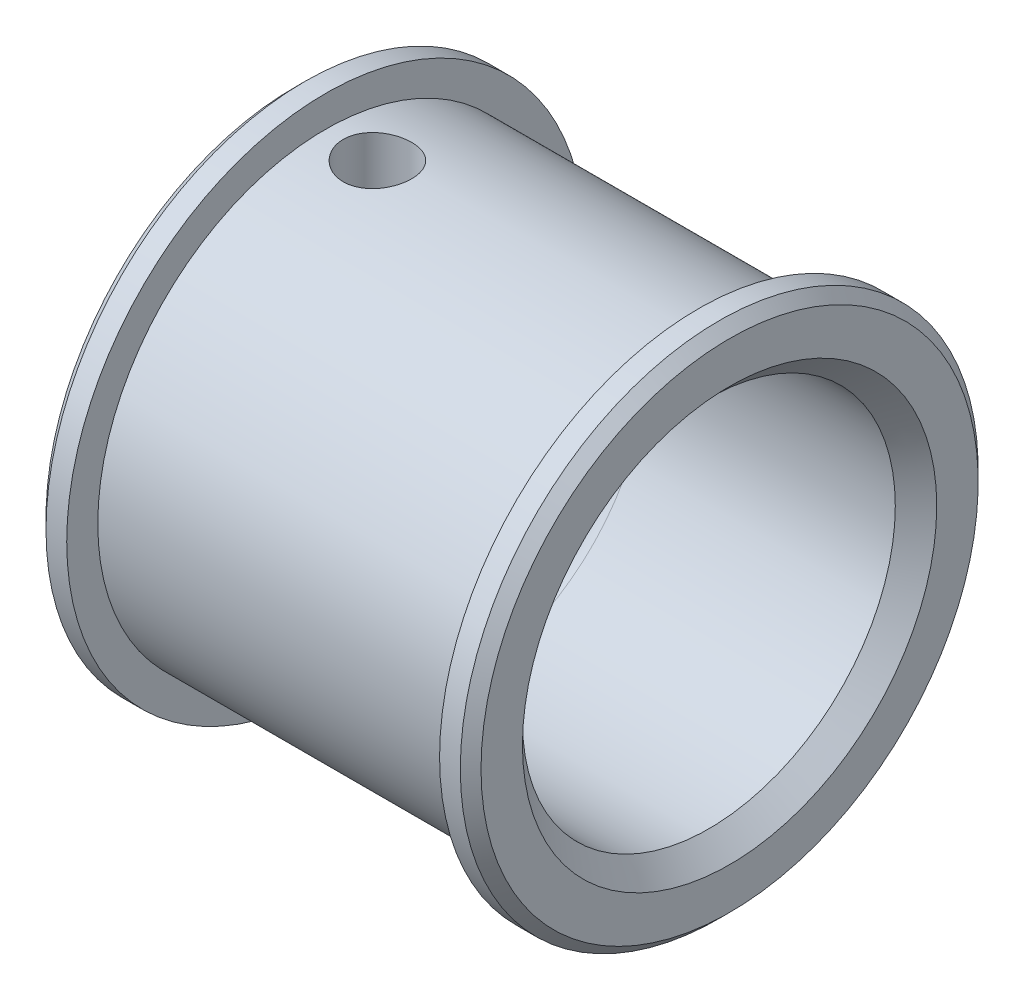
ISO-10303-21;
HEADER;
FILE_DESCRIPTION(('STEP AP214'),'2;1');
FILE_NAME('part.step','',(''),(''),'','','');
FILE_SCHEMA(('AUTOMOTIVE_DESIGN { 1 0 10303 214 1 1 1 1 }'));
ENDSEC;
DATA;
#1=APPLICATION_CONTEXT('core data for automotive mechanical design processes');
#2=APPLICATION_PROTOCOL_DEFINITION('international standard','automotive_design',2000,#1);
#3=PRODUCT_CONTEXT('',#1,'mechanical');
#4=PRODUCT('Part','Part','',(#3));
#5=PRODUCT_RELATED_PRODUCT_CATEGORY('part','',(#4));
#6=PRODUCT_DEFINITION_FORMATION('','',#4);
#7=PRODUCT_DEFINITION_CONTEXT('part definition',#1,'design');
#8=PRODUCT_DEFINITION('design','',#6,#7);
#9=PRODUCT_DEFINITION_SHAPE('','',#8);
#10=(LENGTH_UNIT() NAMED_UNIT(*) SI_UNIT(.MILLI.,.METRE.));
#11=(NAMED_UNIT(*) PLANE_ANGLE_UNIT() SI_UNIT($,.RADIAN.));
#12=(NAMED_UNIT(*) SI_UNIT($,.STERADIAN.) SOLID_ANGLE_UNIT());
#13=UNCERTAINTY_MEASURE_WITH_UNIT(LENGTH_MEASURE(1.E-05),#10,'distance_accuracy_value','');
#14=(GEOMETRIC_REPRESENTATION_CONTEXT(3) GLOBAL_UNCERTAINTY_ASSIGNED_CONTEXT((#13)) GLOBAL_UNIT_ASSIGNED_CONTEXT((#10,
#11,#12)) REPRESENTATION_CONTEXT('',''));
#15=CARTESIAN_POINT('',(0.,0.,0.));
#16=DIRECTION('',(0.,0.,1.));
#17=DIRECTION('',(1.,0.,0.));
#18=AXIS2_PLACEMENT_3D('',#15,#16,#17);
#19=CARTESIAN_POINT('',(-10.5,12.5,0.));
#20=DIRECTION('',(1.,0.,0.));
#21=DIRECTION('',(0.,0.,-1.));
#22=AXIS2_PLACEMENT_3D('',#19,#20,#21);
#23=PLANE('',#22);
#24=CARTESIAN_POINT('',(-10.5,0.,0.));
#25=DIRECTION('',(1.,0.,0.));
#26=DIRECTION('',(0.,0.,-1.));
#27=AXIS2_PLACEMENT_3D('',#24,#25,#26);
#28=CIRCLE('',#27,12.);
#29=CARTESIAN_POINT('',(-10.5,0.,-12.));
#30=VERTEX_POINT('',#29);
#31=EDGE_CURVE('E162',#30,#30,#28,.F.);
#32=ORIENTED_EDGE('',*,*,#31,.T.);
#33=EDGE_LOOP('',(#32));
#34=FACE_BOUND('',#33,.T.);
#35=CARTESIAN_POINT('',(-10.5,0.,0.));
#36=DIRECTION('',(-1.,0.,0.));
#37=DIRECTION('',(0.,0.,1.));
#38=AXIS2_PLACEMENT_3D('',#35,#36,#37);
#39=CIRCLE('',#38,1.5);
#40=CARTESIAN_POINT('',(-10.5,0.,1.5));
#41=VERTEX_POINT('',#40);
#42=EDGE_CURVE('E193',#41,#41,#39,.T.);
#43=ORIENTED_EDGE('',*,*,#42,.F.);
#44=EDGE_LOOP('',(#43));
#45=FACE_BOUND('',#44,.T.);
#46=ADVANCED_FACE('F16',(#34,#45),#23,.F.);
#47=CARTESIAN_POINT('',(-15.8306311619896,0.,0.));
#48=DIRECTION('',(-1.,0.,0.));
#49=DIRECTION('',(0.,0.,1.));
#50=AXIS2_PLACEMENT_3D('',#47,#48,#49);
#51=CYLINDRICAL_SURFACE('',#50,1.5);
#52=CARTESIAN_POINT('',(-5.81261364575664,0.,1.5));
#53=CARTESIAN_POINT('',(-5.81263332444944,0.0221484449998907,1.50000447406715));
#54=CARTESIAN_POINT('',(-5.81154216342061,0.0442761341413573,1.49950927634109));
#55=CARTESIAN_POINT('',(-5.80731407690514,0.0882309407560348,1.49756294449903));
#56=CARTESIAN_POINT('',(-5.80418304299494,0.110058739556767,1.49611456325326));
#57=CARTESIAN_POINT('',(-5.79213894012382,0.17406514586321,1.49047328028752));
#58=CARTESIAN_POINT('',(-5.78056103106485,0.215631523118339,1.48498052511109));
#59=CARTESIAN_POINT('',(-5.7452453340166,0.316953438714507,1.46744293306414));
#60=CARTESIAN_POINT('',(-5.71831774587713,0.375195737109222,1.45348605708138));
#61=CARTESIAN_POINT('',(-5.65864988415341,0.487494349877061,1.41979888355067));
#62=CARTESIAN_POINT('',(-5.62584506054334,0.541493471462896,1.40000270816456));
#63=CARTESIAN_POINT('',(-5.56188220654669,0.639336298720912,1.35783883670072));
#64=CARTESIAN_POINT('',(-5.53099961496453,0.683620767198726,1.33606556934905));
#65=CARTESIAN_POINT('',(-5.46859754913487,0.769517732585909,1.28850839632405));
#66=CARTESIAN_POINT('',(-5.4370776708278,0.811128459664325,1.26272187201679));
#67=CARTESIAN_POINT('',(-5.34316424696104,0.931855501150148,1.17948671828247));
#68=CARTESIAN_POINT('',(-5.28113143282916,1.00727266753873,1.11598629807276));
#69=CARTESIAN_POINT('',(-5.17821680199983,1.12931924692285,0.990098916855103));
#70=CARTESIAN_POINT('',(-5.13589303481992,1.17846008304906,0.931303964781121));
#71=CARTESIAN_POINT('',(-5.05729432656194,1.26861923064038,0.804150695646668));
#72=CARTESIAN_POINT('',(-5.02101128898695,1.30964842834388,0.735805408924681));
#73=CARTESIAN_POINT('',(-4.96347445044817,1.37425523156209,0.604688012192463));
#74=CARTESIAN_POINT('',(-4.94066663412035,1.39968098658133,0.543514926662855));
#75=CARTESIAN_POINT('',(-4.90201404221608,1.44261831335074,0.416346887973423));
#76=CARTESIAN_POINT('',(-4.8861646608905,1.46013512020818,0.350355158091533));
#77=CARTESIAN_POINT('',(-4.86257670412615,1.48616471401119,0.214726616012651));
#78=CARTESIAN_POINT('',(-4.85488982563047,1.494620113907,0.145069469232839));
#79=CARTESIAN_POINT('',(-4.84851747145456,1.50163145239621,0.00485236427368091));
#80=CARTESIAN_POINT('',(-4.84982867653179,1.50019104138851,-0.0657072514139795));
#81=CARTESIAN_POINT('',(-4.86072191383893,1.48819943697544,-0.198055856544781));
#82=CARTESIAN_POINT('',(-4.86944850680373,1.47859051716961,-0.260006547660198));
#83=CARTESIAN_POINT('',(-4.89340859236543,1.45212512243361,-0.381012828513425));
#84=CARTESIAN_POINT('',(-4.9086433349569,1.43526725522268,-0.440067859663008));
#85=CARTESIAN_POINT('',(-4.94558272145756,1.39420159043156,-0.556985503150736));
#86=CARTESIAN_POINT('',(-4.96757157750177,1.36966981058903,-0.614642568564465));
#87=CARTESIAN_POINT('',(-5.01648080586363,1.31471839277816,-0.724782673881045));
#88=CARTESIAN_POINT('',(-5.04340318613218,1.28429635718163,-0.777263593659041));
#89=CARTESIAN_POINT('',(-5.1162317756353,1.20121185017075,-0.902985502421483));
#90=CARTESIAN_POINT('',(-5.16466961182815,1.1452732795972,-0.972607311476642));
#91=CARTESIAN_POINT('',(-5.26677976583923,1.02439312474697,-1.09923918777515));
#92=CARTESIAN_POINT('',(-5.32046906968799,0.95942201849418,-1.1562062400392));
#93=CARTESIAN_POINT('',(-5.43087630999232,0.820030708328009,-1.25906875302783));
#94=CARTESIAN_POINT('',(-5.48763609854247,0.745419859685906,-1.30466286148348));
#95=CARTESIAN_POINT('',(-5.57003302171161,0.626989417453348,-1.36338214886629));
#96=CARTESIAN_POINT('',(-5.59702901112282,0.586448311247488,-1.38133684919243));
#97=CARTESIAN_POINT('',(-5.64897250092498,0.502822395260097,-1.41392509255887));
#98=CARTESIAN_POINT('',(-5.67392252580562,0.459740836545143,-1.42856276901354));
#99=CARTESIAN_POINT('',(-5.71766438687963,0.37512927823825,-1.45293241521923));
#100=CARTESIAN_POINT('',(-5.73682569909761,0.333895642009347,-1.46301415456402));
#101=CARTESIAN_POINT('',(-5.7699619061568,0.248928057972136,-1.47982745388688));
#102=CARTESIAN_POINT('',(-5.78397025059878,0.205212441634933,-1.48658072104476));
#103=CARTESIAN_POINT('',(-5.80006996711576,0.134320181687053,-1.49420358558965));
#104=CARTESIAN_POINT('',(-5.80469497204194,0.107861991820303,-1.49635252195317));
#105=CARTESIAN_POINT('',(-5.81100289706566,0.0542883536749681,-1.49926218434104));
#106=CARTESIAN_POINT('',(-5.81265917440118,0.0271691459158347,-1.50001034175024));
#107=CARTESIAN_POINT('',(-5.81261364575664,0.,-1.5));
#108=B_SPLINE_CURVE_WITH_KNOTS('',3,(#52,#53,#54,#55,#56,#57,#58,#59,#60,#61,#62,#63,#64,#65,
#66,#67,#68,#69,#70,#71,#72,#73,#74,#75,#76,#77,#78,#79,#80,#81,#82,#83,#84,#85,#86,#87,#88,#89,
#90,#91,#92,#93,#94,#95,#96,#97,#98,#99,#100,#101,#102,#103,#104,#105,#106,#107),.UNSPECIFIED.,
.F.,.F.,(4,2,2,2,2,2,2,2,2,2,2,2,2,2,2,2,2,2,2,2,2,2,2,2,2,2,2,4),(0.,0.06637800265653,
0.132565136709904,0.262391568285188,0.458312912660749,0.656535147557365,0.830949570164951,
1.00547827832983,1.35297301132437,1.61471771431487,1.87610872160454,2.08546425100029,
2.29468099946101,2.50521505325031,2.7156714487245,2.90470632319764,3.0937775211868,
3.29225659457519,3.49081662935398,3.7939273115488,4.09805305096362,4.40953989932393,
4.56513131068288,4.7205277568222,4.85993701945224,4.99842465742858,5.07906895311344,
5.16043343232562),.UNSPECIFIED.);
#109=CARTESIAN_POINT('',(-5.81261364575663,0.,1.5));
#110=VERTEX_POINT('',#109);
#111=CARTESIAN_POINT('',(-5.81261364575663,0.,-1.5));
#112=VERTEX_POINT('',#111);
#113=EDGE_CURVE('E57',#110,#112,#108,.T.);
#114=ORIENTED_EDGE('',*,*,#113,.T.);
#115=CARTESIAN_POINT('',(-5.47272096727017,0.099342002139551,-1.49670677375727));
#116=CARTESIAN_POINT('',(-5.55195628237137,0.0733160442846707,-1.49846138718336));
#117=CARTESIAN_POINT('',(-5.63178071175657,0.0487658039922867,-1.49937913836414));
#118=CARTESIAN_POINT('',(-5.79307391920479,0.00408727440559884,-1.50015522131082));
#119=CARTESIAN_POINT('',(-5.87454887184842,-0.0160185740532772,-1.50000829777071));
#120=CARTESIAN_POINT('',(-6.03621952216187,-0.0495089156705912,-1.49927593705374));
#121=CARTESIAN_POINT('',(-6.11637368367455,-0.0630865727855815,-1.49870457316831));
#122=CARTESIAN_POINT('',(-6.27742452717063,-0.0828301995331259,-1.4977447060977));
#123=CARTESIAN_POINT('',(-6.35831887758854,-0.0890144481803957,-1.49735575338465));
#124=CARTESIAN_POINT('',(-6.53009705543598,-0.0933367156437068,-1.49709739232028));
#125=CARTESIAN_POINT('',(-6.62101078119259,-0.0904161424478711,-1.49729618688302));
#126=CARTESIAN_POINT('',(-6.80219068914342,-0.0747002910280119,-1.498156451644));
#127=CARTESIAN_POINT('',(-6.8924541703561,-0.0618759115762149,-1.49881928483044));
#128=CARTESIAN_POINT('',(-7.07472898600546,-0.0277866782560279,-1.49984049101366));
#129=CARTESIAN_POINT('',(-7.16668379753452,-0.00623073003471671,-1.50018686334292));
#130=CARTESIAN_POINT('',(-7.30311343418561,0.0304975066292785,-1.49973994287834));
#131=CARTESIAN_POINT('',(-7.34821918113973,0.04343164609386,-1.49943202217326));
#132=CARTESIAN_POINT('',(-7.43803223678071,0.0705259326607055,-1.49840280870264));
#133=CARTESIAN_POINT('',(-7.4827397358394,0.0846854549998855,-1.49768172554665));
#134=CARTESIAN_POINT('',(-7.52727903273141,0.0993420021400711,-1.49670677375724));
#135=B_SPLINE_CURVE_WITH_KNOTS('',3,(#115,#116,#117,#118,#119,#120,#121,#122,#123,#124,#125,
#126,#127,#128,#129,#130,#131,#132,#133,#134),.UNSPECIFIED.,.F.,.F.,(4,2,2,2,2,2,2,2,2,4),(0.,
0.250363583291111,0.501963816864104,0.745574408540324,0.988581458335004,1.26085109525064,
1.53392382441083,1.81696743144345,1.95772743340833,2.09841608680726),.UNSPECIFIED.);
#136=CARTESIAN_POINT('',(-7.18738635424337,0.,-1.5));
#137=VERTEX_POINT('',#136);
#138=EDGE_CURVE('E11',#112,#137,#135,.T.);
#139=ORIENTED_EDGE('',*,*,#138,.T.);
#140=CARTESIAN_POINT('',(-7.18738635424336,0.,-1.5));
#141=CARTESIAN_POINT('',(-7.18736667555056,0.0221484449998907,-1.50000447406715));
#142=CARTESIAN_POINT('',(-7.18845783657939,0.0442761341413573,-1.49950927634109));
#143=CARTESIAN_POINT('',(-7.19268592309486,0.0882309407560348,-1.49756294449903));
#144=CARTESIAN_POINT('',(-7.19581695700506,0.110058739556767,-1.49611456325326));
#145=CARTESIAN_POINT('',(-7.20786105987618,0.17406514586321,-1.49047328028752));
#146=CARTESIAN_POINT('',(-7.21943896893515,0.21563152311834,-1.48498052511109));
#147=CARTESIAN_POINT('',(-7.2547546659834,0.316953438714508,-1.46744293306414));
#148=CARTESIAN_POINT('',(-7.28168225412287,0.375195737109223,-1.45348605708138));
#149=CARTESIAN_POINT('',(-7.34135011584659,0.487494349877062,-1.41979888355067));
#150=CARTESIAN_POINT('',(-7.37415493945666,0.541493471462898,-1.40000270816456));
#151=CARTESIAN_POINT('',(-7.43811779345331,0.639336298720915,-1.35783883670072));
#152=CARTESIAN_POINT('',(-7.46900038503547,0.683620767198729,-1.33606556934905));
#153=CARTESIAN_POINT('',(-7.53140245086513,0.769517732585911,-1.28850839632405));
#154=CARTESIAN_POINT('',(-7.5629223291722,0.811128459664326,-1.26272187201679));
#155=CARTESIAN_POINT('',(-7.65683575303896,0.93185550115015,-1.17948671828247));
#156=CARTESIAN_POINT('',(-7.71886856717084,1.00727266753873,-1.11598629807275));
#157=CARTESIAN_POINT('',(-7.82178319800017,1.12931924692285,-0.990098916855102));
#158=CARTESIAN_POINT('',(-7.86410696518008,1.17846008304906,-0.93130396478112));
#159=CARTESIAN_POINT('',(-7.94270567343806,1.26861923064038,-0.804150695646667));
#160=CARTESIAN_POINT('',(-7.97898871101305,1.30964842834388,-0.735805408924681));
#161=CARTESIAN_POINT('',(-8.03652554955183,1.37425523156209,-0.604688012192463));
#162=CARTESIAN_POINT('',(-8.05933336587965,1.39968098658133,-0.543514926662855));
#163=CARTESIAN_POINT('',(-8.09798595778392,1.44261831335074,-0.416346887973423));
#164=CARTESIAN_POINT('',(-8.1138353391095,1.46013512020818,-0.350355158091534));
#165=CARTESIAN_POINT('',(-8.13742329587386,1.48616471401119,-0.214726616012652));
#166=CARTESIAN_POINT('',(-8.14511017436953,1.494620113907,-0.145069469232839));
#167=CARTESIAN_POINT('',(-8.15148252854544,1.50163145239621,-0.00485236427368121));
#168=CARTESIAN_POINT('',(-8.15017132346821,1.50019104138851,0.0657072514139789));
#169=CARTESIAN_POINT('',(-8.13927808616107,1.48819943697544,0.198055856544781));
#170=CARTESIAN_POINT('',(-8.13055149319628,1.47859051716961,0.260006547660199));
#171=CARTESIAN_POINT('',(-8.10659140763457,1.45212512243361,0.381012828513426));
#172=CARTESIAN_POINT('',(-8.09135666504309,1.43526725522268,0.440067859663007));
#173=CARTESIAN_POINT('',(-8.05441727854243,1.39420159043156,0.556985503150736));
#174=CARTESIAN_POINT('',(-8.03242842249822,1.36966981058903,0.614642568564467));
#175=CARTESIAN_POINT('',(-7.98351919413637,1.31471839277816,0.724782673881047));
#176=CARTESIAN_POINT('',(-7.95659681386782,1.28429635718163,0.777263593659042));
#177=CARTESIAN_POINT('',(-7.8837682243647,1.20121185017075,0.902985502421482));
#178=CARTESIAN_POINT('',(-7.83533038817185,1.1452732795972,0.972607311476641));
#179=CARTESIAN_POINT('',(-7.73322023416077,1.02439312474697,1.09923918777515));
#180=CARTESIAN_POINT('',(-7.67953093031201,0.959422018494182,1.1562062400392));
#181=CARTESIAN_POINT('',(-7.56912369000768,0.82003070832801,1.25906875302783));
#182=CARTESIAN_POINT('',(-7.51236390145753,0.745419859685907,1.30466286148348));
#183=CARTESIAN_POINT('',(-7.42996697828839,0.62698941745335,1.36338214886629));
#184=CARTESIAN_POINT('',(-7.40297098887718,0.58644831124749,1.38133684919242));
#185=CARTESIAN_POINT('',(-7.35102749907502,0.502822395260099,1.41392509255887));
#186=CARTESIAN_POINT('',(-7.32607747419438,0.459740836545143,1.42856276901354));
#187=CARTESIAN_POINT('',(-7.28233561312037,0.375129278238251,1.45293241521923));
#188=CARTESIAN_POINT('',(-7.26317430090239,0.333895642009349,1.46301415456402));
#189=CARTESIAN_POINT('',(-7.2300380938432,0.248928057972138,1.47982745388688));
#190=CARTESIAN_POINT('',(-7.21602974940122,0.205212441634935,1.48658072104476));
#191=CARTESIAN_POINT('',(-7.19993003288424,0.134320181687054,1.49420358558965));
#192=CARTESIAN_POINT('',(-7.19530502795806,0.107861991820304,1.49635252195317));
#193=CARTESIAN_POINT('',(-7.18899710293434,0.0542883536749683,1.49926218434104));
#194=CARTESIAN_POINT('',(-7.18734082559882,0.0271691459158349,1.50001034175024));
#195=CARTESIAN_POINT('',(-7.18738635424336,0.,1.5));
#196=B_SPLINE_CURVE_WITH_KNOTS('',3,(#140,#141,#142,#143,#144,#145,#146,#147,#148,#149,#150,
#151,#152,#153,#154,#155,#156,#157,#158,#159,#160,#161,#162,#163,#164,#165,#166,#167,#168,#169,
#170,#171,#172,#173,#174,#175,#176,#177,#178,#179,#180,#181,#182,#183,#184,#185,#186,#187,#188,
#189,#190,#191,#192,#193,#194,#195),.UNSPECIFIED.,.F.,.F.,(4,2,2,2,2,2,2,2,2,2,2,2,2,2,2,2,2,2,
2,2,2,2,2,2,2,2,2,4),(0.,0.0663780026565299,0.132565136709904,0.262391568285189,
0.45831291266075,0.656535147557367,0.830949570164954,1.00547827832983,1.35297301132437,
1.61471771431487,1.87610872160454,2.08546425100028,2.29468099946101,2.50521505325031,
2.7156714487245,2.90470632319764,3.0937775211868,3.29225659457519,3.49081662935398,
3.7939273115488,4.09805305096361,4.40953989932393,4.56513131068288,4.7205277568222,
4.85993701945223,4.99842465742858,5.07906895311344,5.16043343232562),.UNSPECIFIED.);
#197=CARTESIAN_POINT('',(-7.18738635424337,0.,1.5));
#198=VERTEX_POINT('',#197);
#199=EDGE_CURVE('E30',#137,#198,#196,.T.);
#200=ORIENTED_EDGE('',*,*,#199,.T.);
#201=CARTESIAN_POINT('',(-7.52727903273141,0.0993420021400713,1.49670677375724));
#202=CARTESIAN_POINT('',(-7.44804371763018,0.073316044285158,1.49846138718334));
#203=CARTESIAN_POINT('',(-7.36821928824495,0.0487658039927383,1.49937913836412));
#204=CARTESIAN_POINT('',(-7.20692608079667,0.00408727440597363,1.50015522131082));
#205=CARTESIAN_POINT('',(-7.12545112815301,-0.0160185740529433,1.50000829777072));
#206=CARTESIAN_POINT('',(-6.9637804778395,-0.0495089156703421,1.49927593705375));
#207=CARTESIAN_POINT('',(-6.88362631632679,-0.0630865727853761,1.49870457316832));
#208=CARTESIAN_POINT('',(-6.72257547283065,-0.0828301995330087,1.49774470609771));
#209=CARTESIAN_POINT('',(-6.64168112241271,-0.0890144481803229,1.49735575338465));
#210=CARTESIAN_POINT('',(-6.46990294456527,-0.0933367156437202,1.49709739232028));
#211=CARTESIAN_POINT('',(-6.37898921880869,-0.0904161424479344,1.49729618688302));
#212=CARTESIAN_POINT('',(-6.19780931085792,-0.0747002910281756,1.49815645164399));
#213=CARTESIAN_POINT('',(-6.10754582964527,-0.0618759115764291,1.49881928483043));
#214=CARTESIAN_POINT('',(-5.92527101399598,-0.0277866782563394,1.49984049101365));
#215=CARTESIAN_POINT('',(-5.83331620246694,-0.00623073003507504,1.50018686334292));
#216=CARTESIAN_POINT('',(-5.69688656581589,0.0304975066288552,1.49973994287835));
#217=CARTESIAN_POINT('',(-5.6517808188618,0.0434316460934161,1.49943202217327));
#218=CARTESIAN_POINT('',(-5.56196776322084,0.0705259326602223,1.49840280870266));
#219=CARTESIAN_POINT('',(-5.51726026416216,0.0846854549993837,1.49768172554667));
#220=CARTESIAN_POINT('',(-5.47272096727017,0.0993420021395515,1.49670677375727));
#221=B_SPLINE_CURVE_WITH_KNOTS('',3,(#201,#202,#203,#204,#205,#206,#207,#208,#209,#210,#211,
#212,#213,#214,#215,#216,#217,#218,#219,#220),.UNSPECIFIED.,.F.,.F.,(4,2,2,2,2,2,2,2,2,4),(0.,
0.250363583291228,0.501963816864339,0.745574408540668,0.988581458335458,1.26085109525099,
1.53392382441107,1.81696743144357,1.95772743340839,2.09841608680726),.UNSPECIFIED.);
#222=EDGE_CURVE('E40',#198,#110,#221,.T.);
#223=ORIENTED_EDGE('',*,*,#222,.T.);
#224=EDGE_LOOP('',(#114,#139,#200,#223));
#225=FACE_BOUND('',#224,.T.);
#226=CARTESIAN_POINT('',(-3.5,0.,0.));
#227=DIRECTION('',(-1.,0.,0.));
#228=DIRECTION('',(0.,0.,1.));
#229=AXIS2_PLACEMENT_3D('',#226,#227,#228);
#230=CIRCLE('',#229,1.5);
#231=CARTESIAN_POINT('',(-3.5,0.,1.5));
#232=VERTEX_POINT('',#231);
#233=EDGE_CURVE('E190',#232,#232,#230,.T.);
#234=ORIENTED_EDGE('',*,*,#233,.F.);
#235=EDGE_LOOP('',(#234));
#236=FACE_BOUND('',#235,.T.);
#237=ORIENTED_EDGE('',*,*,#42,.T.);
#238=EDGE_LOOP('',(#237));
#239=FACE_BOUND('',#238,.T.);
#240=ADVANCED_FACE('F60',(#225,#236,#239),#51,.F.);
#241=CARTESIAN_POINT('',(-3.5,9.,0.));
#242=DIRECTION('',(-1.,0.,0.));
#243=DIRECTION('',(0.,0.,1.));
#244=AXIS2_PLACEMENT_3D('',#241,#242,#243);
#245=PLANE('',#244);
#246=CARTESIAN_POINT('',(-3.5,0.,0.));
#247=DIRECTION('',(-1.,0.,0.));
#248=DIRECTION('',(0.,0.,1.));
#249=AXIS2_PLACEMENT_3D('',#246,#247,#248);
#250=CIRCLE('',#249,8.);
#251=CARTESIAN_POINT('',(-3.5,0.,8.));
#252=VERTEX_POINT('',#251);
#253=EDGE_CURVE('E199',#252,#252,#250,.F.);
#254=ORIENTED_EDGE('',*,*,#253,.T.);
#255=EDGE_LOOP('',(#254));
#256=FACE_BOUND('',#255,.T.);
#257=ORIENTED_EDGE('',*,*,#233,.T.);
#258=EDGE_LOOP('',(#257));
#259=FACE_BOUND('',#258,.T.);
#260=ADVANCED_FACE('F118',(#256,#259),#245,.F.);
#261=CARTESIAN_POINT('',(-15.8306311619896,0.,0.));
#262=DIRECTION('',(-1.,0.,0.));
#263=DIRECTION('',(0.,0.,1.));
#264=AXIS2_PLACEMENT_3D('',#261,#262,#263);
#265=CYLINDRICAL_SURFACE('',#264,9.);
#266=CARTESIAN_POINT('',(9.5,0.,0.));
#267=DIRECTION('',(-1.,0.,0.));
#268=DIRECTION('',(0.,0.,1.));
#269=AXIS2_PLACEMENT_3D('',#266,#267,#268);
#270=CIRCLE('',#269,9.);
#271=CARTESIAN_POINT('',(9.5,0.,9.));
#272=VERTEX_POINT('',#271);
#273=EDGE_CURVE('E160',#272,#272,#270,.F.);
#274=ORIENTED_EDGE('',*,*,#273,.T.);
#275=EDGE_LOOP('',(#274));
#276=FACE_BOUND('',#275,.T.);
#277=CARTESIAN_POINT('',(-2.5,0.,0.));
#278=DIRECTION('',(-1.,0.,0.));
#279=DIRECTION('',(0.,0.,1.));
#280=AXIS2_PLACEMENT_3D('',#277,#278,#279);
#281=CIRCLE('',#280,9.);
#282=CARTESIAN_POINT('',(-2.5,0.,9.));
#283=VERTEX_POINT('',#282);
#284=EDGE_CURVE('E196',#283,#283,#281,.T.);
#285=ORIENTED_EDGE('',*,*,#284,.T.);
#286=EDGE_LOOP('',(#285));
#287=FACE_BOUND('',#286,.T.);
#288=ADVANCED_FACE('F115',(#276,#287),#265,.F.);
#289=CARTESIAN_POINT('',(10.5,12.5,0.));
#290=DIRECTION('',(-1.,0.,0.));
#291=DIRECTION('',(0.,0.,1.));
#292=AXIS2_PLACEMENT_3D('',#289,#290,#291);
#293=PLANE('',#292);
#294=CARTESIAN_POINT('',(10.5,0.,0.));
#295=DIRECTION('',(-1.,0.,0.));
#296=DIRECTION('',(0.,0.,1.));
#297=AXIS2_PLACEMENT_3D('',#294,#295,#296);
#298=CIRCLE('',#297,12.);
#299=CARTESIAN_POINT('',(10.5,0.,12.));
#300=VERTEX_POINT('',#299);
#301=EDGE_CURVE('E156',#300,#300,#298,.F.);
#302=ORIENTED_EDGE('',*,*,#301,.T.);
#303=EDGE_LOOP('',(#302));
#304=FACE_BOUND('',#303,.T.);
#305=CARTESIAN_POINT('',(10.5,0.,0.));
#306=DIRECTION('',(-1.,0.,0.));
#307=DIRECTION('',(0.,0.,1.));
#308=AXIS2_PLACEMENT_3D('',#305,#306,#307);
#309=CIRCLE('',#308,10.);
#310=CARTESIAN_POINT('',(10.5,0.,10.));
#311=VERTEX_POINT('',#310);
#312=EDGE_CURVE('E165',#311,#311,#309,.T.);
#313=ORIENTED_EDGE('',*,*,#312,.T.);
#314=EDGE_LOOP('',(#313));
#315=FACE_BOUND('',#314,.T.);
#316=ADVANCED_FACE('F111',(#304,#315),#293,.F.);
#317=CARTESIAN_POINT('',(-15.8306311619896,0.,0.));
#318=DIRECTION('',(-1.,0.,0.));
#319=DIRECTION('',(0.,0.,1.));
#320=AXIS2_PLACEMENT_3D('',#317,#318,#319);
#321=CYLINDRICAL_SURFACE('',#320,12.5);
#322=CARTESIAN_POINT('',(10.,0.,0.));
#323=DIRECTION('',(-1.,0.,0.));
#324=DIRECTION('',(0.,0.,1.));
#325=AXIS2_PLACEMENT_3D('',#322,#323,#324);
#326=CIRCLE('',#325,12.5);
#327=CARTESIAN_POINT('',(10.,0.,12.5));
#328=VERTEX_POINT('',#327);
#329=EDGE_CURVE('E159',#328,#328,#326,.T.);
#330=ORIENTED_EDGE('',*,*,#329,.T.);
#331=EDGE_LOOP('',(#330));
#332=FACE_BOUND('',#331,.T.);
#333=CARTESIAN_POINT('',(9.,0.,0.));
#334=DIRECTION('',(-1.,0.,0.));
#335=DIRECTION('',(0.,0.,1.));
#336=AXIS2_PLACEMENT_3D('',#333,#334,#335);
#337=CIRCLE('',#336,12.5);
#338=CARTESIAN_POINT('',(9.,0.,12.5));
#339=VERTEX_POINT('',#338);
#340=EDGE_CURVE('E185',#339,#339,#337,.T.);
#341=ORIENTED_EDGE('',*,*,#340,.F.);
#342=EDGE_LOOP('',(#341));
#343=FACE_BOUND('',#342,.T.);
#344=ADVANCED_FACE('F107',(#332,#343),#321,.T.);
#345=CARTESIAN_POINT('',(9.,11.,0.));
#346=DIRECTION('',(1.,0.,0.));
#347=DIRECTION('',(0.,0.,-1.));
#348=AXIS2_PLACEMENT_3D('',#345,#346,#347);
#349=PLANE('',#348);
#350=CARTESIAN_POINT('',(9.,0.,0.));
#351=DIRECTION('',(-1.,0.,0.));
#352=DIRECTION('',(0.,0.,1.));
#353=AXIS2_PLACEMENT_3D('',#350,#351,#352);
#354=CIRCLE('',#353,11.);
#355=CARTESIAN_POINT('',(9.,0.,11.));
#356=VERTEX_POINT('',#355);
#357=EDGE_CURVE('E181',#356,#356,#354,.T.);
#358=ORIENTED_EDGE('',*,*,#357,.F.);
#359=EDGE_LOOP('',(#358));
#360=FACE_BOUND('',#359,.T.);
#361=ORIENTED_EDGE('',*,*,#340,.T.);
#362=EDGE_LOOP('',(#361));
#363=FACE_BOUND('',#362,.T.);
#364=ADVANCED_FACE('F103',(#360,#363),#349,.F.);
#365=CARTESIAN_POINT('',(-15.8306311619896,0.,0.));
#366=DIRECTION('',(-1.,0.,0.));
#367=DIRECTION('',(0.,0.,1.));
#368=AXIS2_PLACEMENT_3D('',#365,#366,#367);
#369=CYLINDRICAL_SURFACE('',#368,11.);
#370=CARTESIAN_POINT('',(-6.5,10.8755459633069,1.65));
#371=CARTESIAN_POINT('',(-6.59212012621895,10.8755475033545,1.64999619518013));
#372=CARTESIAN_POINT('',(-6.68429372582578,10.8767290691301,1.6422592602734));
#373=CARTESIAN_POINT('',(-6.86606384637144,10.8813244628356,1.61152416322701));
#374=CARTESIAN_POINT('',(-6.95565776462801,10.8847404680457,1.5885111154289));
#375=CARTESIAN_POINT('',(-7.12961113099159,10.8934093288485,1.52792778707892));
#376=CARTESIAN_POINT('',(-7.21397453879637,10.8986607744469,1.49036867849537));
#377=CARTESIAN_POINT('',(-7.37518973384929,10.9104071352446,1.4017856939657));
#378=CARTESIAN_POINT('',(-7.45204255323572,10.9169018792203,1.35076367172858));
#379=CARTESIAN_POINT('',(-7.59668219842976,10.9304611817284,1.23626692660414));
#380=CARTESIAN_POINT('',(-7.66440017474741,10.9375294870386,1.17270566143302));
#381=CARTESIAN_POINT('',(-7.78825123422105,10.9514060498595,1.03512156598881));
#382=CARTESIAN_POINT('',(-7.84438368038369,10.9582142930548,0.961098160865181));
#383=CARTESIAN_POINT('',(-7.9437242948605,10.97084282171,0.804249993858017));
#384=CARTESIAN_POINT('',(-7.98686906535471,10.9766582027913,0.721384650102343));
#385=CARTESIAN_POINT('',(-8.05860275868899,10.9866042742105,0.549481735117672));
#386=CARTESIAN_POINT('',(-8.08719245062717,10.9907350535614,0.460444490297743));
#387=CARTESIAN_POINT('',(-8.12879572738392,10.9968200627756,0.279434235399624));
#388=CARTESIAN_POINT('',(-8.14192459902588,10.9987903947608,0.187488272828852));
#389=CARTESIAN_POINT('',(-8.15259152830738,11.0003876924654,0.00267872442142729));
#390=CARTESIAN_POINT('',(-8.15013045265165,11.0000147884543,-0.0901848101173201));
#391=CARTESIAN_POINT('',(-8.12977832846132,10.9969804962687,-0.273406890020572));
#392=CARTESIAN_POINT('',(-8.11201131102937,10.9943375041773,-0.36377956054001));
#393=CARTESIAN_POINT('',(-8.06174633304517,10.9870805025064,-0.540246112057451));
#394=CARTESIAN_POINT('',(-8.02924799334841,10.9824664421971,-0.626339882864827));
#395=CARTESIAN_POINT('',(-7.95031590339118,10.9717541326053,-0.792180158847346));
#396=CARTESIAN_POINT('',(-7.90382993838038,10.965650338672,-0.871901439555957));
#397=CARTESIAN_POINT('',(-7.79828028696302,10.9526388206996,-1.0224586978652));
#398=CARTESIAN_POINT('',(-7.73921577262244,10.945731043755,-1.0932940900989));
#399=CARTESIAN_POINT('',(-7.60949470629075,10.9318017401189,-1.22479993099491));
#400=CARTESIAN_POINT('',(-7.53872986583288,10.9247797628558,-1.28536356246041));
#401=CARTESIAN_POINT('',(-7.38798481516389,10.9114797489888,-1.39377259272694));
#402=CARTESIAN_POINT('',(-7.30800454820808,10.9052017169661,-1.44161791320798));
#403=CARTESIAN_POINT('',(-7.14098764076529,10.8941005281554,-1.52324660988065));
#404=CARTESIAN_POINT('',(-7.05394555297137,10.8892785082982,-1.5570190049709));
#405=CARTESIAN_POINT('',(-6.87533621933787,10.8816554318896,-1.60943569829767));
#406=CARTESIAN_POINT('',(-6.78376929289857,10.8788542329093,-1.62808106271058));
#407=CARTESIAN_POINT('',(-6.59965990146476,10.8756169653453,-1.6495679209532));
#408=CARTESIAN_POINT('',(-6.50713549297831,10.8751582368283,-1.65256083591557));
#409=CARTESIAN_POINT('',(-6.32290638570093,10.8765976873087,-1.64305962721801));
#410=CARTESIAN_POINT('',(-6.23120166156416,10.8784957931736,-1.63056598410532));
#411=CARTESIAN_POINT('',(-6.0516842002378,10.884414227076,-1.59057473248042));
#412=CARTESIAN_POINT('',(-5.96385427456423,10.8884238813114,-1.56315256380603));
#413=CARTESIAN_POINT('',(-5.79403749874653,10.8981048200834,-1.49416115141795));
#414=CARTESIAN_POINT('',(-5.71205093740898,10.9037761866789,-1.45259120904027));
#415=CARTESIAN_POINT('',(-5.55556941363145,10.9161949125577,-1.35612045794855));
#416=CARTESIAN_POINT('',(-5.4811355079922,10.9229500520799,-1.30112163017943));
#417=CARTESIAN_POINT('',(-5.34249985413881,10.9367517537669,-1.17949058520921));
#418=CARTESIAN_POINT('',(-5.27829868490074,10.9437983323932,-1.11285771019147));
#419=CARTESIAN_POINT('',(-5.16140713270306,10.9574597573912,-0.969183181590997));
#420=CARTESIAN_POINT('',(-5.10881709893328,10.9640705180646,-0.892059439449152));
#421=CARTESIAN_POINT('',(-5.0173398042111,10.9760519553522,-0.729984288290049));
#422=CARTESIAN_POINT('',(-4.97845216838847,10.9814226658902,-0.64503309349648));
#423=CARTESIAN_POINT('',(-4.91564388326317,10.9903009662687,-0.470027795447259));
#424=CARTESIAN_POINT('',(-4.8916683662138,10.9938153788969,-0.379993744629732));
#425=CARTESIAN_POINT('',(-4.85918733250878,10.9986137432259,-0.197120897051313));
#426=CARTESIAN_POINT('',(-4.85068079412595,10.9998978422388,-0.104282285943639));
#427=CARTESIAN_POINT('',(-4.84940412499566,11.0000894196506,0.0805910499469015));
#428=CARTESIAN_POINT('',(-4.85648045103533,10.9990200872618,0.172624727233259));
#429=CARTESIAN_POINT('',(-4.88583952726283,10.9946717157105,0.354177774855418));
#430=CARTESIAN_POINT('',(-4.90812222878942,10.9913926836193,0.443697153236162));
#431=CARTESIAN_POINT('',(-4.96720706312727,10.9829916541671,0.617638311817626));
#432=CARTESIAN_POINT('',(-5.00399856465283,10.9778710064864,0.702063772463663));
#433=CARTESIAN_POINT('',(-5.09104023678146,10.9663491794505,0.863567229686264));
#434=CARTESIAN_POINT('',(-5.14129084432838,10.9599479585237,0.940644987612776));
#435=CARTESIAN_POINT('',(-5.2543794687121,10.946501616998,1.08604384371115));
#436=CARTESIAN_POINT('',(-5.31733084839798,10.9394510326854,1.15427627309102));
#437=CARTESIAN_POINT('',(-5.45379558038852,10.925541018579,1.27926489229295));
#438=CARTESIAN_POINT('',(-5.52731140820678,10.9186816340392,1.33601838478882));
#439=CARTESIAN_POINT('',(-5.68330388155579,10.9058893243203,1.43672441905271));
#440=CARTESIAN_POINT('',(-5.76582855872401,10.8999618217268,1.4806032372033));
#441=CARTESIAN_POINT('',(-5.93712645443963,10.889768000218,1.55381175259249));
#442=CARTESIAN_POINT('',(-6.02589307864361,10.8854999583872,1.58315654832386));
#443=CARTESIAN_POINT('',(-6.17921517988213,10.8800943407731,1.61980447079028));
#444=CARTESIAN_POINT('',(-6.2428237366167,10.8783977432062,1.63111046758462));
#445=CARTESIAN_POINT('',(-6.37094612090779,10.8761230222371,1.64620951634232));
#446=CARTESIAN_POINT('',(-6.43545993671957,10.8755448843377,1.65000266568583));
#447=CARTESIAN_POINT('',(-6.5,10.8755459633069,1.65));
#448=B_SPLINE_CURVE_WITH_KNOTS('',3,(#370,#371,#372,#373,#374,#375,#376,#377,#378,#379,#380,
#381,#382,#383,#384,#385,#386,#387,#388,#389,#390,#391,#392,#393,#394,#395,#396,#397,#398,#399,
#400,#401,#402,#403,#404,#405,#406,#407,#408,#409,#410,#411,#412,#413,#414,#415,#416,#417,#418,
#419,#420,#421,#422,#423,#424,#425,#426,#427,#428,#429,#430,#431,#432,#433,#434,#435,#436,#437,
#438,#439,#440,#441,#442,#443,#444,#445,#446,#447),.UNSPECIFIED.,.T.,.F.,(4,2,2,2,2,2,2,2,2,2,2,
2,2,2,2,2,2,2,2,2,2,2,2,2,2,2,2,2,2,2,2,2,2,2,2,2,2,2,4),(0.,0.276124476985355,
0.552518416517985,0.828700493869239,1.10484456352745,1.38296574514018,1.66110221428599,
1.9405751431636,2.2200333030095,2.49739415787836,2.77473959333311,3.049858487673,
3.32498446323341,3.60115048025098,3.87733468044198,4.15623499132895,4.43513701965784,
4.71425626950451,4.99335584488774,5.26975036064117,5.54613630009909,5.82113834288111,
6.09615396814728,6.37324034601431,6.65034239607981,6.92975291528866,7.20915578979038,
7.48752444980197,7.76587472287519,8.04149459984558,8.31711359482104,8.59253100483615,
8.86795735723815,9.14596045012064,9.42402879260546,9.70365966707422,9.98299943790118,
10.1764568608077,10.3699117761381),.UNSPECIFIED.);
#449=CARTESIAN_POINT('',(-6.5,10.8755459633069,1.65));
#450=VERTEX_POINT('',#449);
#451=EDGE_CURVE('E58',#450,#450,#448,.T.);
#452=ORIENTED_EDGE('',*,*,#451,.T.);
#453=EDGE_LOOP('',(#452));
#454=FACE_BOUND('',#453,.T.);
#455=CARTESIAN_POINT('',(-9.,0.,0.));
#456=DIRECTION('',(-1.,0.,0.));
#457=DIRECTION('',(0.,0.,1.));
#458=AXIS2_PLACEMENT_3D('',#455,#456,#457);
#459=CIRCLE('',#458,11.);
#460=CARTESIAN_POINT('',(-9.,0.,11.));
#461=VERTEX_POINT('',#460);
#462=EDGE_CURVE('E179',#461,#461,#459,.T.);
#463=ORIENTED_EDGE('',*,*,#462,.F.);
#464=EDGE_LOOP('',(#463));
#465=FACE_BOUND('',#464,.T.);
#466=ORIENTED_EDGE('',*,*,#357,.T.);
#467=EDGE_LOOP('',(#466));
#468=FACE_BOUND('',#467,.T.);
#469=ADVANCED_FACE('F97',(#454,#465,#468),#369,.T.);
#470=CARTESIAN_POINT('',(-9.,12.5,0.));
#471=DIRECTION('',(-1.,0.,0.));
#472=DIRECTION('',(0.,0.,1.));
#473=AXIS2_PLACEMENT_3D('',#470,#471,#472);
#474=PLANE('',#473);
#475=CARTESIAN_POINT('',(-9.,0.,0.));
#476=DIRECTION('',(-1.,0.,0.));
#477=DIRECTION('',(0.,0.,1.));
#478=AXIS2_PLACEMENT_3D('',#475,#476,#477);
#479=CIRCLE('',#478,12.5);
#480=CARTESIAN_POINT('',(-9.,0.,12.5));
#481=VERTEX_POINT('',#480);
#482=EDGE_CURVE('E95',#481,#481,#479,.T.);
#483=ORIENTED_EDGE('',*,*,#482,.F.);
#484=EDGE_LOOP('',(#483));
#485=FACE_BOUND('',#484,.T.);
#486=ORIENTED_EDGE('',*,*,#462,.T.);
#487=EDGE_LOOP('',(#486));
#488=FACE_BOUND('',#487,.T.);
#489=ADVANCED_FACE('F102',(#485,#488),#474,.F.);
#490=CARTESIAN_POINT('',(-15.8306311619896,0.,0.));
#491=DIRECTION('',(-1.,0.,0.));
#492=DIRECTION('',(0.,0.,1.));
#493=AXIS2_PLACEMENT_3D('',#490,#491,#492);
#494=CYLINDRICAL_SURFACE('',#493,12.5);
#495=CARTESIAN_POINT('',(-10.,0.,0.));
#496=DIRECTION('',(1.,0.,0.));
#497=DIRECTION('',(0.,0.,-1.));
#498=AXIS2_PLACEMENT_3D('',#495,#496,#497);
#499=CIRCLE('',#498,12.5);
#500=CARTESIAN_POINT('',(-10.,0.,-12.5));
#501=VERTEX_POINT('',#500);
#502=EDGE_CURVE('E63',#501,#501,#499,.T.);
#503=ORIENTED_EDGE('',*,*,#502,.T.);
#504=EDGE_LOOP('',(#503));
#505=FACE_BOUND('',#504,.T.);
#506=ORIENTED_EDGE('',*,*,#482,.T.);
#507=EDGE_LOOP('',(#506));
#508=FACE_BOUND('',#507,.T.);
#509=ADVANCED_FACE('F141',(#505,#508),#494,.T.);
#510=CARTESIAN_POINT('',(-2.5,0.,0.));
#511=DIRECTION('',(-1.,0.,0.));
#512=DIRECTION('',(0.,0.,1.));
#513=AXIS2_PLACEMENT_3D('',#510,#511,#512);
#514=TOROIDAL_SURFACE('',#513,8.,1.);
#515=ORIENTED_EDGE('',*,*,#253,.F.);
#516=EDGE_LOOP('',(#515));
#517=FACE_BOUND('',#516,.T.);
#518=ORIENTED_EDGE('',*,*,#284,.F.);
#519=EDGE_LOOP('',(#518));
#520=FACE_BOUND('',#519,.T.);
#521=ADVANCED_FACE('F137',(#517,#520),#514,.F.);
#522=CARTESIAN_POINT('',(10.5,0.,0.));
#523=DIRECTION('',(1.,0.,0.));
#524=DIRECTION('',(0.,0.,-1.));
#525=AXIS2_PLACEMENT_3D('',#522,#523,#524);
#526=CONICAL_SURFACE('',#525,10.,0.785398163397445);
#527=ORIENTED_EDGE('',*,*,#273,.F.);
#528=EDGE_LOOP('',(#527));
#529=FACE_BOUND('',#528,.T.);
#530=ORIENTED_EDGE('',*,*,#312,.F.);
#531=EDGE_LOOP('',(#530));
#532=FACE_BOUND('',#531,.T.);
#533=ADVANCED_FACE('F140',(#529,#532),#526,.F.);
#534=CARTESIAN_POINT('',(10.,0.,0.));
#535=DIRECTION('',(-1.,0.,0.));
#536=DIRECTION('',(0.,0.,1.));
#537=AXIS2_PLACEMENT_3D('',#534,#535,#536);
#538=CONICAL_SURFACE('',#537,12.5,0.785398163397448);
#539=ORIENTED_EDGE('',*,*,#301,.F.);
#540=EDGE_LOOP('',(#539));
#541=FACE_BOUND('',#540,.T.);
#542=ORIENTED_EDGE('',*,*,#329,.F.);
#543=EDGE_LOOP('',(#542));
#544=FACE_BOUND('',#543,.T.);
#545=ADVANCED_FACE('F144',(#541,#544),#538,.T.);
#546=CARTESIAN_POINT('',(-10.5,0.,0.));
#547=DIRECTION('',(1.,0.,0.));
#548=DIRECTION('',(0.,0.,-1.));
#549=AXIS2_PLACEMENT_3D('',#546,#547,#548);
#550=CONICAL_SURFACE('',#549,12.,0.785398163397443);
#551=ORIENTED_EDGE('',*,*,#502,.F.);
#552=EDGE_LOOP('',(#551));
#553=FACE_BOUND('',#552,.T.);
#554=ORIENTED_EDGE('',*,*,#31,.F.);
#555=EDGE_LOOP('',(#554));
#556=FACE_BOUND('',#555,.T.);
#557=ADVANCED_FACE('F18',(#553,#556),#550,.T.);
#558=CARTESIAN_POINT('',(-6.5,11.,0.));
#559=DIRECTION('',(0.,1.,0.));
#560=DIRECTION('',(0.,0.,1.));
#561=AXIS2_PLACEMENT_3D('',#558,#559,#560);
#562=CYLINDRICAL_SURFACE('',#561,1.65);
#563=CARTESIAN_POINT('',(-6.5,0.,0.));
#564=DIRECTION('',(0.,1.,0.));
#565=DIRECTION('',(0.,0.,1.));
#566=AXIS2_PLACEMENT_3D('',#563,#564,#565);
#567=CIRCLE('',#566,1.65);
#568=EDGE_CURVE('E50',#112,#137,#567,.T.);
#569=ORIENTED_EDGE('',*,*,#568,.F.);
#570=ORIENTED_EDGE('',*,*,#113,.F.);
#571=EDGE_CURVE('E36',#198,#110,#567,.T.);
#572=ORIENTED_EDGE('',*,*,#571,.F.);
#573=ORIENTED_EDGE('',*,*,#199,.F.);
#574=EDGE_LOOP('',(#569,#570,#572,#573));
#575=FACE_BOUND('',#574,.T.);
#576=ORIENTED_EDGE('',*,*,#451,.F.);
#577=EDGE_LOOP('',(#576));
#578=FACE_BOUND('',#577,.T.);
#579=ADVANCED_FACE('F55',(#575,#578),#562,.F.);
#580=CARTESIAN_POINT('',(-6.5,0.,0.));
#581=DIRECTION('',(0.,1.,0.));
#582=DIRECTION('',(0.,0.,1.));
#583=AXIS2_PLACEMENT_3D('',#580,#581,#582);
#584=CONICAL_SURFACE('',#583,1.65,1.02974425867665);
#585=ORIENTED_EDGE('',*,*,#568,.T.);
#586=ORIENTED_EDGE('',*,*,#138,.F.);
#587=EDGE_LOOP('',(#585,#586));
#588=FACE_BOUND('',#587,.T.);
#589=ADVANCED_FACE('F49',(#588),#584,.F.);
#590=ORIENTED_EDGE('',*,*,#571,.T.);
#591=ORIENTED_EDGE('',*,*,#222,.F.);
#592=EDGE_LOOP('',(#590,#591));
#593=FACE_BOUND('',#592,.T.);
#594=ADVANCED_FACE('F268',(#593),#584,.F.);
#595=CLOSED_SHELL('',(#46,#240,#260,#288,#316,#344,#364,#469,#489,#509,#521,#533,#545,#557,#579,
#589,#594));
#596=MANIFOLD_SOLID_BREP('B1',#595);
#597=ADVANCED_BREP_SHAPE_REPRESENTATION('',(#18,#596),#14);
#598=SHAPE_DEFINITION_REPRESENTATION(#9,#597);
ENDSEC;
END-ISO-10303-21;
